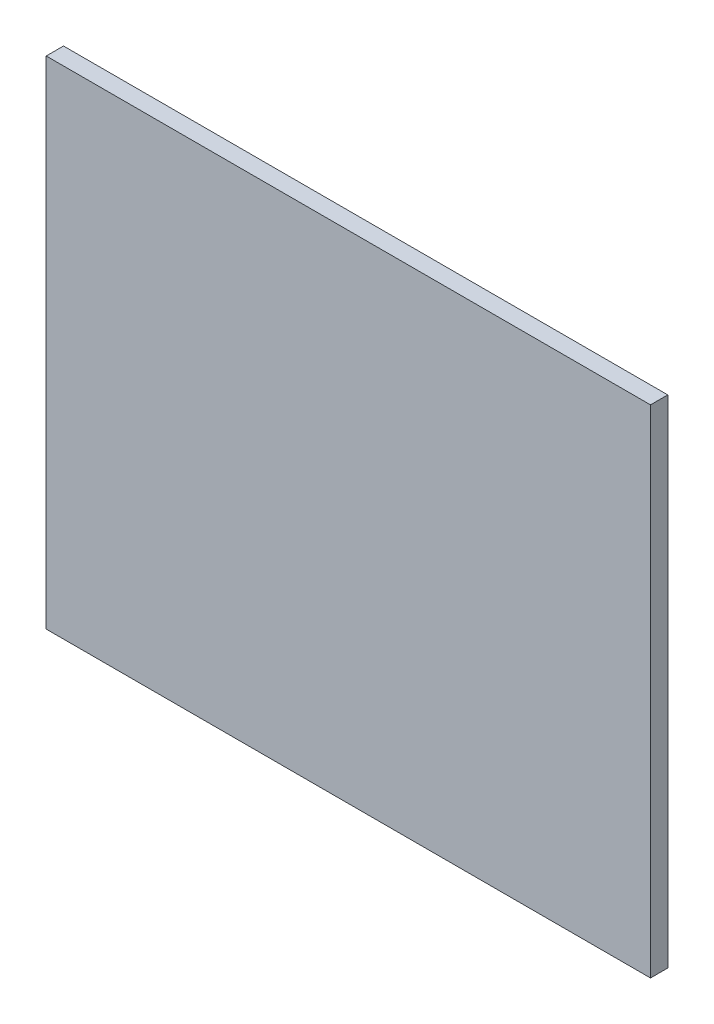
ISO-10303-21;
HEADER;
FILE_DESCRIPTION(('STEP AP214'),'2;1');
FILE_NAME('part.step','',(''),(''),'','','');
FILE_SCHEMA(('AUTOMOTIVE_DESIGN { 1 0 10303 214 1 1 1 1 }'));
ENDSEC;
DATA;
#1=APPLICATION_CONTEXT('core data for automotive mechanical design processes');
#2=APPLICATION_PROTOCOL_DEFINITION('international standard','automotive_design',2000,#1);
#3=PRODUCT_CONTEXT('',#1,'mechanical');
#4=PRODUCT('Part','Part','',(#3));
#5=PRODUCT_RELATED_PRODUCT_CATEGORY('part','',(#4));
#6=PRODUCT_DEFINITION_FORMATION('','',#4);
#7=PRODUCT_DEFINITION_CONTEXT('part definition',#1,'design');
#8=PRODUCT_DEFINITION('design','',#6,#7);
#9=PRODUCT_DEFINITION_SHAPE('','',#8);
#10=(LENGTH_UNIT() NAMED_UNIT(*) SI_UNIT(.MILLI.,.METRE.));
#11=(NAMED_UNIT(*) PLANE_ANGLE_UNIT() SI_UNIT($,.RADIAN.));
#12=(NAMED_UNIT(*) SI_UNIT($,.STERADIAN.) SOLID_ANGLE_UNIT());
#13=UNCERTAINTY_MEASURE_WITH_UNIT(LENGTH_MEASURE(1.E-05),#10,'distance_accuracy_value','');
#14=(GEOMETRIC_REPRESENTATION_CONTEXT(3) GLOBAL_UNCERTAINTY_ASSIGNED_CONTEXT((#13)) GLOBAL_UNIT_ASSIGNED_CONTEXT((#10,
#11,#12)) REPRESENTATION_CONTEXT('',''));
#15=CARTESIAN_POINT('',(0.,0.,0.));
#16=DIRECTION('',(0.,0.,1.));
#17=DIRECTION('',(1.,0.,0.));
#18=AXIS2_PLACEMENT_3D('',#15,#16,#17);
#19=CARTESIAN_POINT('',(-63.5839340885685,46.0659114315139,4.));
#20=DIRECTION('',(1.,0.,0.));
#21=DIRECTION('',(0.,0.,-1.));
#22=AXIS2_PLACEMENT_3D('',#19,#20,#21);
#23=PLANE('',#22);
#24=DIRECTION('',(0.,-1.,0.));
#25=VECTOR('',#24,1.);
#26=CARTESIAN_POINT('',(-63.5839340885685,46.0659114315139,0.));
#27=LINE('',#26,#25);
#28=CARTESIAN_POINT('',(-63.5839340885685,46.0659114315139,0.));
#29=VERTEX_POINT('',#28);
#30=CARTESIAN_POINT('',(-63.5839340885685,-68.9340885684861,0.));
#31=VERTEX_POINT('',#30);
#32=EDGE_CURVE('E111',#29,#31,#27,.T.);
#33=ORIENTED_EDGE('',*,*,#32,.T.);
#34=DIRECTION('',(0.,0.,-1.));
#35=VECTOR('',#34,1.);
#36=CARTESIAN_POINT('',(-63.5839340885685,-68.9340885684861,4.));
#37=LINE('',#36,#35);
#38=CARTESIAN_POINT('',(-63.5839340885685,-68.9340885684861,4.));
#39=VERTEX_POINT('',#38);
#40=EDGE_CURVE('E11',#39,#31,#37,.T.);
#41=ORIENTED_EDGE('',*,*,#40,.F.);
#42=DIRECTION('',(0.,-1.,0.));
#43=VECTOR('',#42,1.);
#44=CARTESIAN_POINT('',(-63.5839340885685,46.0659114315139,4.));
#45=LINE('',#44,#43);
#46=CARTESIAN_POINT('',(-63.5839340885685,46.0659114315139,4.));
#47=VERTEX_POINT('',#46);
#48=EDGE_CURVE('E95',#47,#39,#45,.T.);
#49=ORIENTED_EDGE('',*,*,#48,.F.);
#50=DIRECTION('',(0.,0.,-1.));
#51=VECTOR('',#50,1.);
#52=CARTESIAN_POINT('',(-63.5839340885685,46.0659114315139,4.));
#53=LINE('',#52,#51);
#54=EDGE_CURVE('E107',#47,#29,#53,.T.);
#55=ORIENTED_EDGE('',*,*,#54,.T.);
#56=EDGE_LOOP('',(#33,#41,#49,#55));
#57=FACE_BOUND('',#56,.T.);
#58=ADVANCED_FACE('F43',(#57),#23,.F.);
#59=CARTESIAN_POINT('',(-63.5839340885685,-68.9340885684861,4.));
#60=DIRECTION('',(0.,1.,0.));
#61=DIRECTION('',(0.,0.,1.));
#62=AXIS2_PLACEMENT_3D('',#59,#60,#61);
#63=PLANE('',#62);
#64=DIRECTION('',(1.,0.,0.));
#65=VECTOR('',#64,1.);
#66=CARTESIAN_POINT('',(-63.5839340885685,-68.9340885684861,0.));
#67=LINE('',#66,#65);
#68=CARTESIAN_POINT('',(76.4160659114316,-68.9340885684861,0.));
#69=VERTEX_POINT('',#68);
#70=EDGE_CURVE('E100',#31,#69,#67,.T.);
#71=ORIENTED_EDGE('',*,*,#70,.T.);
#72=DIRECTION('',(0.,0.,-1.));
#73=VECTOR('',#72,1.);
#74=CARTESIAN_POINT('',(76.4160659114316,-68.9340885684861,4.));
#75=LINE('',#74,#73);
#76=CARTESIAN_POINT('',(76.4160659114316,-68.9340885684861,4.));
#77=VERTEX_POINT('',#76);
#78=EDGE_CURVE('E52',#77,#69,#75,.T.);
#79=ORIENTED_EDGE('',*,*,#78,.F.);
#80=DIRECTION('',(1.,0.,0.));
#81=VECTOR('',#80,1.);
#82=CARTESIAN_POINT('',(-63.5839340885685,-68.9340885684861,4.));
#83=LINE('',#82,#81);
#84=EDGE_CURVE('E90',#39,#77,#83,.T.);
#85=ORIENTED_EDGE('',*,*,#84,.F.);
#86=ORIENTED_EDGE('',*,*,#40,.T.);
#87=EDGE_LOOP('',(#71,#79,#85,#86));
#88=FACE_BOUND('',#87,.T.);
#89=ADVANCED_FACE('F99',(#88),#63,.F.);
#90=CARTESIAN_POINT('',(76.4160659114315,46.0659114315139,4.));
#91=DIRECTION('',(-1.,0.,0.));
#92=DIRECTION('',(0.,-1.,0.));
#93=AXIS2_PLACEMENT_3D('',#90,#91,#92);
#94=PLANE('',#93);
#95=DIRECTION('',(0.,1.,0.));
#96=VECTOR('',#95,1.);
#97=CARTESIAN_POINT('',(76.4160659114315,46.0659114315139,0.));
#98=LINE('',#97,#96);
#99=CARTESIAN_POINT('',(76.4160659114315,46.0659114315139,0.));
#100=VERTEX_POINT('',#99);
#101=EDGE_CURVE('E77',#69,#100,#98,.T.);
#102=ORIENTED_EDGE('',*,*,#101,.T.);
#103=DIRECTION('',(0.,0.,-1.));
#104=VECTOR('',#103,1.);
#105=CARTESIAN_POINT('',(76.4160659114315,46.0659114315139,4.));
#106=LINE('',#105,#104);
#107=CARTESIAN_POINT('',(76.4160659114315,46.0659114315139,4.));
#108=VERTEX_POINT('',#107);
#109=EDGE_CURVE('E102',#108,#100,#106,.T.);
#110=ORIENTED_EDGE('',*,*,#109,.F.);
#111=DIRECTION('',(0.,1.,0.));
#112=VECTOR('',#111,1.);
#113=CARTESIAN_POINT('',(76.4160659114315,46.0659114315139,4.));
#114=LINE('',#113,#112);
#115=EDGE_CURVE('E93',#77,#108,#114,.T.);
#116=ORIENTED_EDGE('',*,*,#115,.F.);
#117=ORIENTED_EDGE('',*,*,#78,.T.);
#118=EDGE_LOOP('',(#102,#110,#116,#117));
#119=FACE_BOUND('',#118,.T.);
#120=ADVANCED_FACE('F103',(#119),#94,.F.);
#121=CARTESIAN_POINT('',(-63.5839340885685,46.0659114315139,4.));
#122=DIRECTION('',(0.,-1.,0.));
#123=DIRECTION('',(0.,0.,-1.));
#124=AXIS2_PLACEMENT_3D('',#121,#122,#123);
#125=PLANE('',#124);
#126=DIRECTION('',(-1.,0.,0.));
#127=VECTOR('',#126,1.);
#128=CARTESIAN_POINT('',(-63.5839340885685,46.0659114315139,0.));
#129=LINE('',#128,#127);
#130=EDGE_CURVE('E83',#100,#29,#129,.T.);
#131=ORIENTED_EDGE('',*,*,#130,.T.);
#132=ORIENTED_EDGE('',*,*,#54,.F.);
#133=DIRECTION('',(-1.,0.,0.));
#134=VECTOR('',#133,1.);
#135=CARTESIAN_POINT('',(-63.5839340885685,46.0659114315139,4.));
#136=LINE('',#135,#134);
#137=EDGE_CURVE('E60',#108,#47,#136,.T.);
#138=ORIENTED_EDGE('',*,*,#137,.F.);
#139=ORIENTED_EDGE('',*,*,#109,.T.);
#140=EDGE_LOOP('',(#131,#132,#138,#139));
#141=FACE_BOUND('',#140,.T.);
#142=ADVANCED_FACE('F124',(#141),#125,.F.);
#143=CARTESIAN_POINT('',(0.,0.,4.));
#144=DIRECTION('',(0.,0.,1.));
#145=DIRECTION('',(1.,0.,0.));
#146=AXIS2_PLACEMENT_3D('',#143,#144,#145);
#147=PLANE('',#146);
#148=ORIENTED_EDGE('',*,*,#48,.T.);
#149=ORIENTED_EDGE('',*,*,#84,.T.);
#150=ORIENTED_EDGE('',*,*,#115,.T.);
#151=ORIENTED_EDGE('',*,*,#137,.T.);
#152=EDGE_LOOP('',(#148,#149,#150,#151));
#153=FACE_BOUND('',#152,.T.);
#154=ADVANCED_FACE('F91',(#153),#147,.T.);
#155=CARTESIAN_POINT('',(0.,0.,0.));
#156=DIRECTION('',(0.,0.,1.));
#157=DIRECTION('',(1.,0.,0.));
#158=AXIS2_PLACEMENT_3D('',#155,#156,#157);
#159=PLANE('',#158);
#160=ORIENTED_EDGE('',*,*,#32,.F.);
#161=ORIENTED_EDGE('',*,*,#130,.F.);
#162=ORIENTED_EDGE('',*,*,#101,.F.);
#163=ORIENTED_EDGE('',*,*,#70,.F.);
#164=EDGE_LOOP('',(#160,#161,#162,#163));
#165=FACE_BOUND('',#164,.T.);
#166=ADVANCED_FACE('F127',(#165),#159,.F.);
#167=CLOSED_SHELL('',(#58,#89,#120,#142,#154,#166));
#168=MANIFOLD_SOLID_BREP('B2',#167);
#169=ADVANCED_BREP_SHAPE_REPRESENTATION('',(#18,#168),#14);
#170=SHAPE_DEFINITION_REPRESENTATION(#9,#169);
ENDSEC;
END-ISO-10303-21;
